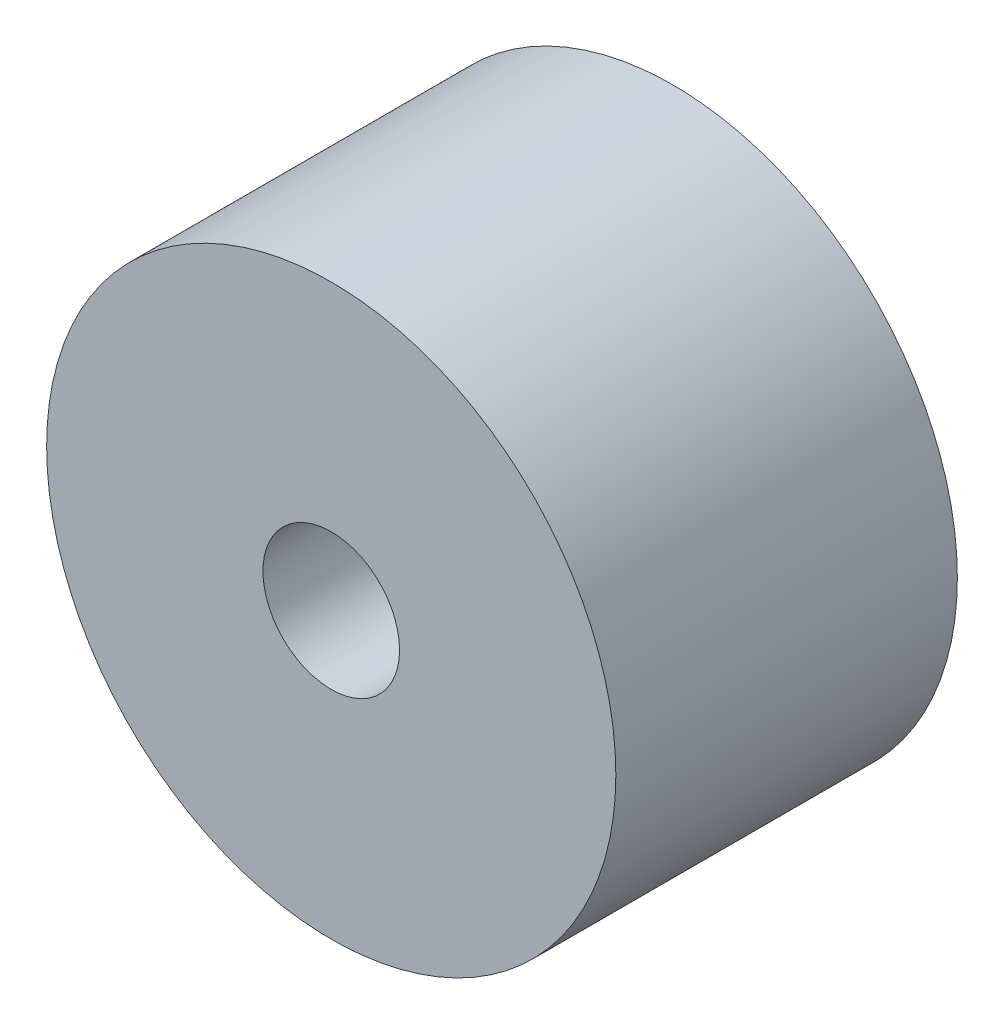
ISO-10303-21;
HEADER;
FILE_DESCRIPTION(('STEP AP214'),'2;1');
FILE_NAME('part.step','',(''),(''),'','','');
FILE_SCHEMA(('AUTOMOTIVE_DESIGN { 1 0 10303 214 1 1 1 1 }'));
ENDSEC;
DATA;
#1=APPLICATION_CONTEXT('core data for automotive mechanical design processes');
#2=APPLICATION_PROTOCOL_DEFINITION('international standard','automotive_design',2000,#1);
#3=PRODUCT_CONTEXT('',#1,'mechanical');
#4=PRODUCT('Part','Part','',(#3));
#5=PRODUCT_RELATED_PRODUCT_CATEGORY('part','',(#4));
#6=PRODUCT_DEFINITION_FORMATION('','',#4);
#7=PRODUCT_DEFINITION_CONTEXT('part definition',#1,'design');
#8=PRODUCT_DEFINITION('design','',#6,#7);
#9=PRODUCT_DEFINITION_SHAPE('','',#8);
#10=(LENGTH_UNIT() NAMED_UNIT(*) SI_UNIT(.MILLI.,.METRE.));
#11=(NAMED_UNIT(*) PLANE_ANGLE_UNIT() SI_UNIT($,.RADIAN.));
#12=(NAMED_UNIT(*) SI_UNIT($,.STERADIAN.) SOLID_ANGLE_UNIT());
#13=UNCERTAINTY_MEASURE_WITH_UNIT(LENGTH_MEASURE(1.E-05),#10,'distance_accuracy_value','');
#14=(GEOMETRIC_REPRESENTATION_CONTEXT(3) GLOBAL_UNCERTAINTY_ASSIGNED_CONTEXT((#13)) GLOBAL_UNIT_ASSIGNED_CONTEXT((#10,
#11,#12)) REPRESENTATION_CONTEXT('',''));
#15=CARTESIAN_POINT('',(0.,0.,0.));
#16=DIRECTION('',(0.,0.,1.));
#17=DIRECTION('',(1.,0.,0.));
#18=AXIS2_PLACEMENT_3D('',#15,#16,#17);
#19=CARTESIAN_POINT('',(0.,0.,30.));
#20=DIRECTION('',(0.,0.,1.));
#21=DIRECTION('',(1.,0.,0.));
#22=AXIS2_PLACEMENT_3D('',#19,#20,#21);
#23=PLANE('',#22);
#24=CARTESIAN_POINT('',(0.,0.,30.));
#25=DIRECTION('',(0.,0.,1.));
#26=DIRECTION('',(1.,0.,0.));
#27=AXIS2_PLACEMENT_3D('',#24,#25,#26);
#28=CIRCLE('',#27,24.9999999999999);
#29=CARTESIAN_POINT('',(24.9999999999999,0.,30.));
#30=VERTEX_POINT('',#29);
#31=EDGE_CURVE('E10',#30,#30,#28,.T.);
#32=ORIENTED_EDGE('',*,*,#31,.T.);
#33=EDGE_LOOP('',(#32));
#34=FACE_BOUND('',#33,.T.);
#35=CARTESIAN_POINT('',(0.,0.,30.));
#36=DIRECTION('',(0.,0.,1.));
#37=DIRECTION('',(1.,0.,0.));
#38=AXIS2_PLACEMENT_3D('',#35,#36,#37);
#39=CIRCLE('',#38,6.);
#40=CARTESIAN_POINT('',(6.,0.,30.));
#41=VERTEX_POINT('',#40);
#42=EDGE_CURVE('E44',#41,#41,#39,.T.);
#43=ORIENTED_EDGE('',*,*,#42,.F.);
#44=EDGE_LOOP('',(#43));
#45=FACE_BOUND('',#44,.T.);
#46=ADVANCED_FACE('F33',(#34,#45),#23,.T.);
#47=CARTESIAN_POINT('',(0.,0.,0.));
#48=DIRECTION('',(0.,0.,1.));
#49=DIRECTION('',(1.,0.,0.));
#50=AXIS2_PLACEMENT_3D('',#47,#48,#49);
#51=PLANE('',#50);
#52=CARTESIAN_POINT('',(0.,0.,0.));
#53=DIRECTION('',(0.,0.,1.));
#54=DIRECTION('',(1.,0.,0.));
#55=AXIS2_PLACEMENT_3D('',#52,#53,#54);
#56=CIRCLE('',#55,24.9999999999999);
#57=CARTESIAN_POINT('',(24.9999999999999,0.,0.));
#58=VERTEX_POINT('',#57);
#59=EDGE_CURVE('E37',#58,#58,#56,.T.);
#60=ORIENTED_EDGE('',*,*,#59,.F.);
#61=EDGE_LOOP('',(#60));
#62=FACE_BOUND('',#61,.T.);
#63=CARTESIAN_POINT('',(0.,0.,0.));
#64=DIRECTION('',(0.,0.,1.));
#65=DIRECTION('',(1.,0.,0.));
#66=AXIS2_PLACEMENT_3D('',#63,#64,#65);
#67=CIRCLE('',#66,6.);
#68=CARTESIAN_POINT('',(6.,0.,0.));
#69=VERTEX_POINT('',#68);
#70=EDGE_CURVE('E46',#69,#69,#67,.T.);
#71=ORIENTED_EDGE('',*,*,#70,.T.);
#72=EDGE_LOOP('',(#71));
#73=FACE_BOUND('',#72,.T.);
#74=ADVANCED_FACE('F56',(#62,#73),#51,.F.);
#75=CARTESIAN_POINT('',(0.,0.,30.));
#76=DIRECTION('',(0.,0.,-1.));
#77=DIRECTION('',(-1.,0.,0.));
#78=AXIS2_PLACEMENT_3D('',#75,#76,#77);
#79=CYLINDRICAL_SURFACE('',#78,24.9999999999999);
#80=ORIENTED_EDGE('',*,*,#31,.F.);
#81=EDGE_LOOP('',(#80));
#82=FACE_BOUND('',#81,.T.);
#83=ORIENTED_EDGE('',*,*,#59,.T.);
#84=EDGE_LOOP('',(#83));
#85=FACE_BOUND('',#84,.T.);
#86=ADVANCED_FACE('F35',(#82,#85),#79,.T.);
#87=CARTESIAN_POINT('',(0.,0.,30.));
#88=DIRECTION('',(0.,0.,-1.));
#89=DIRECTION('',(-1.,0.,0.));
#90=AXIS2_PLACEMENT_3D('',#87,#88,#89);
#91=CYLINDRICAL_SURFACE('',#90,6.);
#92=ORIENTED_EDGE('',*,*,#42,.T.);
#93=EDGE_LOOP('',(#92));
#94=FACE_BOUND('',#93,.T.);
#95=ORIENTED_EDGE('',*,*,#70,.F.);
#96=EDGE_LOOP('',(#95));
#97=FACE_BOUND('',#96,.T.);
#98=ADVANCED_FACE('F52',(#94,#97),#91,.F.);
#99=CLOSED_SHELL('',(#46,#74,#86,#98));
#100=MANIFOLD_SOLID_BREP('B2',#99);
#101=ADVANCED_BREP_SHAPE_REPRESENTATION('',(#18,#100),#14);
#102=SHAPE_DEFINITION_REPRESENTATION(#9,#101);
ENDSEC;
END-ISO-10303-21;
